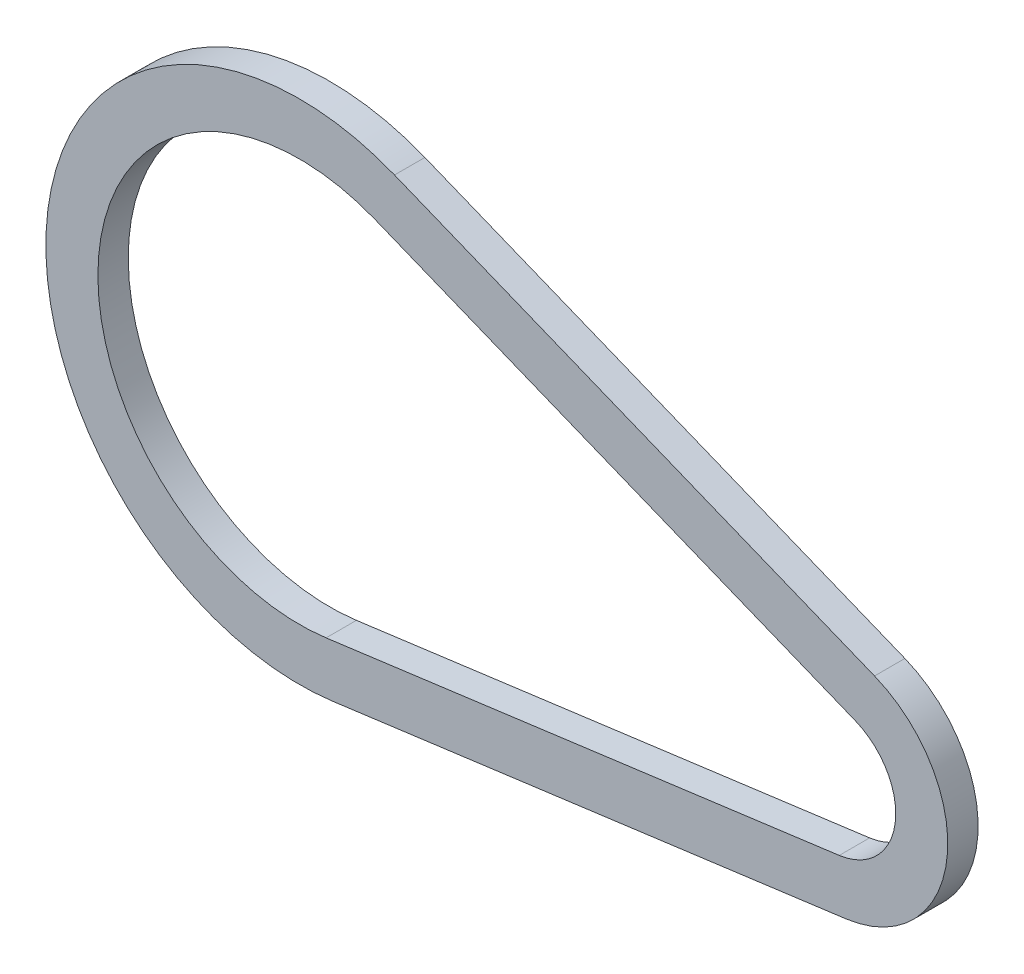
ISO-10303-21;
HEADER;
FILE_DESCRIPTION(('STEP AP214'),'2;1');
FILE_NAME('part.step','',(''),(''),'','','');
FILE_SCHEMA(('AUTOMOTIVE_DESIGN { 1 0 10303 214 1 1 1 1 }'));
ENDSEC;
DATA;
#1=APPLICATION_CONTEXT('core data for automotive mechanical design processes');
#2=APPLICATION_PROTOCOL_DEFINITION('international standard','automotive_design',2000,#1);
#3=PRODUCT_CONTEXT('',#1,'mechanical');
#4=PRODUCT('Part','Part','',(#3));
#5=PRODUCT_RELATED_PRODUCT_CATEGORY('part','',(#4));
#6=PRODUCT_DEFINITION_FORMATION('','',#4);
#7=PRODUCT_DEFINITION_CONTEXT('part definition',#1,'design');
#8=PRODUCT_DEFINITION('design','',#6,#7);
#9=PRODUCT_DEFINITION_SHAPE('','',#8);
#10=(LENGTH_UNIT() NAMED_UNIT(*) SI_UNIT(.MILLI.,.METRE.));
#11=(NAMED_UNIT(*) PLANE_ANGLE_UNIT() SI_UNIT($,.RADIAN.));
#12=(NAMED_UNIT(*) SI_UNIT($,.STERADIAN.) SOLID_ANGLE_UNIT());
#13=UNCERTAINTY_MEASURE_WITH_UNIT(LENGTH_MEASURE(1.E-05),#10,'distance_accuracy_value','');
#14=(GEOMETRIC_REPRESENTATION_CONTEXT(3) GLOBAL_UNCERTAINTY_ASSIGNED_CONTEXT((#13)) GLOBAL_UNIT_ASSIGNED_CONTEXT((#10,
#11,#12)) REPRESENTATION_CONTEXT('',''));
#15=CARTESIAN_POINT('',(0.,0.,0.));
#16=DIRECTION('',(0.,0.,1.));
#17=DIRECTION('',(1.,0.,0.));
#18=AXIS2_PLACEMENT_3D('',#15,#16,#17);
#19=CARTESIAN_POINT('',(-122.5,15.5,3.5));
#20=DIRECTION('',(0.,0.,1.));
#21=DIRECTION('',(1.,0.,0.));
#22=AXIS2_PLACEMENT_3D('',#19,#20,#21);
#23=PLANE('',#22);
#24=CARTESIAN_POINT('',(-122.5,15.5,3.5));
#25=DIRECTION('',(0.,0.,1.));
#26=DIRECTION('',(1.,0.,0.));
#27=AXIS2_PLACEMENT_3D('',#24,#25,#26);
#28=CIRCLE('',#27,58.5);
#29=CARTESIAN_POINT('',(-100.593673118403,69.7435511610056,3.5));
#30=VERTEX_POINT('',#29);
#31=CARTESIAN_POINT('',(-114.79469470372,-42.4903291100431,3.5));
#32=VERTEX_POINT('',#31);
#33=EDGE_CURVE('E134',#30,#32,#28,.T.);
#34=ORIENTED_EDGE('',*,*,#33,.T.);
#35=DIRECTION('',(0.991287677094754,0.131714620449235,0.));
#36=VECTOR('',#35,1.);
#37=CARTESIAN_POINT('',(-114.79469470372,-42.4903291100431,3.5));
#38=LINE('',#37,#36);
#39=CARTESIAN_POINT('',(3.55629475212935,-26.7647672815584,3.5));
#40=VERTEX_POINT('',#39);
#41=EDGE_CURVE('E137',#32,#40,#38,.T.);
#42=ORIENTED_EDGE('',*,*,#41,.T.);
#43=CARTESIAN_POINT('',(0.,0.,3.5));
#44=DIRECTION('',(0.,0.,1.));
#45=DIRECTION('',(1.,0.,0.));
#46=AXIS2_PLACEMENT_3D('',#43,#44,#45);
#47=CIRCLE('',#46,27.);
#48=CARTESIAN_POINT('',(10.1106124068908,25.0354851512334,3.5));
#49=VERTEX_POINT('',#48);
#50=EDGE_CURVE('E140',#40,#49,#47,.T.);
#51=ORIENTED_EDGE('',*,*,#50,.T.);
#52=DIRECTION('',(-0.927240190786421,0.374467126181139,0.));
#53=VECTOR('',#52,1.);
#54=CARTESIAN_POINT('',(-100.593673118403,69.7435511610056,3.5));
#55=LINE('',#54,#53);
#56=EDGE_CURVE('E142',#49,#30,#55,.T.);
#57=ORIENTED_EDGE('',*,*,#56,.T.);
#58=EDGE_LOOP('',(#34,#42,#51,#57));
#59=FACE_BOUND('',#58,.T.);
#60=DIRECTION('',(0.991287677094754,0.131714620449235,0.));
#61=VECTOR('',#60,1.);
#62=CARTESIAN_POINT('',(-116.375270149111,-30.5948769849061,3.5));
#63=LINE('',#62,#61);
#64=CARTESIAN_POINT('',(-116.375270149111,-30.5948769849061,3.5));
#65=VERTEX_POINT('',#64);
#66=CARTESIAN_POINT('',(1.97571930673853,-14.8693151564213,3.5));
#67=VERTEX_POINT('',#66);
#68=EDGE_CURVE('E106',#65,#67,#63,.T.);
#69=ORIENTED_EDGE('',*,*,#68,.F.);
#70=CARTESIAN_POINT('',(-122.5,15.5,3.5));
#71=DIRECTION('',(0.,0.,1.));
#72=DIRECTION('',(1.,0.,0.));
#73=AXIS2_PLACEMENT_3D('',#70,#71,#72);
#74=CIRCLE('',#73,46.5);
#75=CARTESIAN_POINT('',(-105.087278632577,58.6166688715686,3.5));
#76=VERTEX_POINT('',#75);
#77=EDGE_CURVE('E98',#76,#65,#74,.T.);
#78=ORIENTED_EDGE('',*,*,#77,.F.);
#79=DIRECTION('',(-0.927240190786421,0.374467126181139,0.));
#80=VECTOR('',#79,1.);
#81=CARTESIAN_POINT('',(-105.087278632577,58.6166688715686,3.5));
#82=LINE('',#81,#80);
#83=CARTESIAN_POINT('',(5.61700689271707,13.9086028617963,3.5));
#84=VERTEX_POINT('',#83);
#85=EDGE_CURVE('E120',#84,#76,#82,.T.);
#86=ORIENTED_EDGE('',*,*,#85,.F.);
#87=CARTESIAN_POINT('',(0.,0.,3.5));
#88=DIRECTION('',(0.,0.,1.));
#89=DIRECTION('',(1.,0.,0.));
#90=AXIS2_PLACEMENT_3D('',#87,#88,#89);
#91=CIRCLE('',#90,15.);
#92=EDGE_CURVE('E118',#67,#84,#91,.T.);
#93=ORIENTED_EDGE('',*,*,#92,.F.);
#94=EDGE_LOOP('',(#69,#78,#86,#93));
#95=FACE_BOUND('',#94,.T.);
#96=ADVANCED_FACE('F33',(#59,#95),#23,.T.);
#97=CARTESIAN_POINT('',(-122.5,15.5,-3.5));
#98=DIRECTION('',(0.,0.,1.));
#99=DIRECTION('',(1.,0.,0.));
#100=AXIS2_PLACEMENT_3D('',#97,#98,#99);
#101=PLANE('',#100);
#102=CARTESIAN_POINT('',(-122.5,15.5,-3.5));
#103=DIRECTION('',(0.,0.,1.));
#104=DIRECTION('',(1.,0.,0.));
#105=AXIS2_PLACEMENT_3D('',#102,#103,#104);
#106=CIRCLE('',#105,58.5);
#107=CARTESIAN_POINT('',(-100.593673118403,69.7435511610056,-3.5));
#108=VERTEX_POINT('',#107);
#109=CARTESIAN_POINT('',(-114.79469470372,-42.4903291100431,-3.5));
#110=VERTEX_POINT('',#109);
#111=EDGE_CURVE('E114',#108,#110,#106,.T.);
#112=ORIENTED_EDGE('',*,*,#111,.F.);
#113=DIRECTION('',(-0.927240190786421,0.374467126181139,0.));
#114=VECTOR('',#113,1.);
#115=CARTESIAN_POINT('',(-100.593673118403,69.7435511610056,-3.5));
#116=LINE('',#115,#114);
#117=CARTESIAN_POINT('',(10.1106124068908,25.0354851512334,-3.5));
#118=VERTEX_POINT('',#117);
#119=EDGE_CURVE('E138',#118,#108,#116,.T.);
#120=ORIENTED_EDGE('',*,*,#119,.F.);
#121=CARTESIAN_POINT('',(0.,0.,-3.5));
#122=DIRECTION('',(0.,0.,1.));
#123=DIRECTION('',(1.,0.,0.));
#124=AXIS2_PLACEMENT_3D('',#121,#122,#123);
#125=CIRCLE('',#124,27.);
#126=CARTESIAN_POINT('',(3.55629475212935,-26.7647672815584,-3.5));
#127=VERTEX_POINT('',#126);
#128=EDGE_CURVE('E149',#127,#118,#125,.T.);
#129=ORIENTED_EDGE('',*,*,#128,.F.);
#130=DIRECTION('',(0.991287677094754,0.131714620449235,0.));
#131=VECTOR('',#130,1.);
#132=CARTESIAN_POINT('',(-114.79469470372,-42.4903291100431,-3.5));
#133=LINE('',#132,#131);
#134=EDGE_CURVE('E147',#110,#127,#133,.T.);
#135=ORIENTED_EDGE('',*,*,#134,.F.);
#136=EDGE_LOOP('',(#112,#120,#129,#135));
#137=FACE_BOUND('',#136,.T.);
#138=CARTESIAN_POINT('',(-122.5,15.5,-3.5));
#139=DIRECTION('',(0.,0.,1.));
#140=DIRECTION('',(1.,0.,0.));
#141=AXIS2_PLACEMENT_3D('',#138,#139,#140);
#142=CIRCLE('',#141,46.5);
#143=CARTESIAN_POINT('',(-105.087278632577,58.6166688715686,-3.5));
#144=VERTEX_POINT('',#143);
#145=CARTESIAN_POINT('',(-116.375270149111,-30.5948769849061,-3.5));
#146=VERTEX_POINT('',#145);
#147=EDGE_CURVE('E56',#144,#146,#142,.T.);
#148=ORIENTED_EDGE('',*,*,#147,.T.);
#149=DIRECTION('',(0.991287677094754,0.131714620449235,0.));
#150=VECTOR('',#149,1.);
#151=CARTESIAN_POINT('',(-116.375270149111,-30.5948769849061,-3.5));
#152=LINE('',#151,#150);
#153=CARTESIAN_POINT('',(1.97571930673853,-14.8693151564213,-3.5));
#154=VERTEX_POINT('',#153);
#155=EDGE_CURVE('E113',#146,#154,#152,.T.);
#156=ORIENTED_EDGE('',*,*,#155,.T.);
#157=CARTESIAN_POINT('',(0.,0.,-3.5));
#158=DIRECTION('',(0.,0.,1.));
#159=DIRECTION('',(1.,0.,0.));
#160=AXIS2_PLACEMENT_3D('',#157,#158,#159);
#161=CIRCLE('',#160,15.);
#162=CARTESIAN_POINT('',(5.61700689271708,13.9086028617963,-3.5));
#163=VERTEX_POINT('',#162);
#164=EDGE_CURVE('E126',#154,#163,#161,.T.);
#165=ORIENTED_EDGE('',*,*,#164,.T.);
#166=DIRECTION('',(-0.927240190786421,0.374467126181139,0.));
#167=VECTOR('',#166,1.);
#168=CARTESIAN_POINT('',(-105.087278632577,58.6166688715686,-3.5));
#169=LINE('',#168,#167);
#170=EDGE_CURVE('E107',#163,#144,#169,.T.);
#171=ORIENTED_EDGE('',*,*,#170,.T.);
#172=EDGE_LOOP('',(#148,#156,#165,#171));
#173=FACE_BOUND('',#172,.T.);
#174=ADVANCED_FACE('F167',(#137,#173),#101,.F.);
#175=CARTESIAN_POINT('',(-122.5,15.5,3.5));
#176=DIRECTION('',(0.,0.,-1.));
#177=DIRECTION('',(-1.,0.,0.));
#178=AXIS2_PLACEMENT_3D('',#175,#176,#177);
#179=CYLINDRICAL_SURFACE('',#178,58.5);
#180=ORIENTED_EDGE('',*,*,#111,.T.);
#181=DIRECTION('',(0.,0.,-1.));
#182=VECTOR('',#181,1.);
#183=CARTESIAN_POINT('',(-114.79469470372,-42.4903291100431,3.5));
#184=LINE('',#183,#182);
#185=EDGE_CURVE('E11',#32,#110,#184,.T.);
#186=ORIENTED_EDGE('',*,*,#185,.F.);
#187=ORIENTED_EDGE('',*,*,#33,.F.);
#188=DIRECTION('',(0.,0.,-1.));
#189=VECTOR('',#188,1.);
#190=CARTESIAN_POINT('',(-100.593673118403,69.7435511610056,3.5));
#191=LINE('',#190,#189);
#192=EDGE_CURVE('E144',#30,#108,#191,.T.);
#193=ORIENTED_EDGE('',*,*,#192,.T.);
#194=EDGE_LOOP('',(#180,#186,#187,#193));
#195=FACE_BOUND('',#194,.T.);
#196=ADVANCED_FACE('F35',(#195),#179,.T.);
#197=CARTESIAN_POINT('',(-114.79469470372,-42.4903291100431,3.5));
#198=DIRECTION('',(-0.131714620449235,0.991287677094754,0.));
#199=DIRECTION('',(-0.991287677094754,-0.131714620449235,0.));
#200=AXIS2_PLACEMENT_3D('',#197,#198,#199);
#201=PLANE('',#200);
#202=ORIENTED_EDGE('',*,*,#134,.T.);
#203=DIRECTION('',(0.,0.,-1.));
#204=VECTOR('',#203,1.);
#205=CARTESIAN_POINT('',(3.55629475212935,-26.7647672815584,3.5));
#206=LINE('',#205,#204);
#207=EDGE_CURVE('E41',#40,#127,#206,.T.);
#208=ORIENTED_EDGE('',*,*,#207,.F.);
#209=ORIENTED_EDGE('',*,*,#41,.F.);
#210=ORIENTED_EDGE('',*,*,#185,.T.);
#211=EDGE_LOOP('',(#202,#208,#209,#210));
#212=FACE_BOUND('',#211,.T.);
#213=ADVANCED_FACE('F177',(#212),#201,.F.);
#214=CARTESIAN_POINT('',(0.,0.,3.5));
#215=DIRECTION('',(0.,0.,-1.));
#216=DIRECTION('',(-1.,0.,0.));
#217=AXIS2_PLACEMENT_3D('',#214,#215,#216);
#218=CYLINDRICAL_SURFACE('',#217,27.);
#219=ORIENTED_EDGE('',*,*,#128,.T.);
#220=DIRECTION('',(0.,0.,-1.));
#221=VECTOR('',#220,1.);
#222=CARTESIAN_POINT('',(10.1106124068908,25.0354851512334,3.5));
#223=LINE('',#222,#221);
#224=EDGE_CURVE('E154',#49,#118,#223,.T.);
#225=ORIENTED_EDGE('',*,*,#224,.F.);
#226=ORIENTED_EDGE('',*,*,#50,.F.);
#227=ORIENTED_EDGE('',*,*,#207,.T.);
#228=EDGE_LOOP('',(#219,#225,#226,#227));
#229=FACE_BOUND('',#228,.T.);
#230=ADVANCED_FACE('F161',(#229),#218,.T.);
#231=CARTESIAN_POINT('',(-100.593673118403,69.7435511610056,3.5));
#232=DIRECTION('',(-0.374467126181139,-0.927240190786421,0.));
#233=DIRECTION('',(0.927240190786421,-0.374467126181139,0.));
#234=AXIS2_PLACEMENT_3D('',#231,#232,#233);
#235=PLANE('',#234);
#236=ORIENTED_EDGE('',*,*,#119,.T.);
#237=ORIENTED_EDGE('',*,*,#192,.F.);
#238=ORIENTED_EDGE('',*,*,#56,.F.);
#239=ORIENTED_EDGE('',*,*,#224,.T.);
#240=EDGE_LOOP('',(#236,#237,#238,#239));
#241=FACE_BOUND('',#240,.T.);
#242=ADVANCED_FACE('F171',(#241),#235,.F.);
#243=CARTESIAN_POINT('',(-122.5,15.5,3.5));
#244=DIRECTION('',(0.,0.,-1.));
#245=DIRECTION('',(-1.,0.,0.));
#246=AXIS2_PLACEMENT_3D('',#243,#244,#245);
#247=CYLINDRICAL_SURFACE('',#246,46.5);
#248=ORIENTED_EDGE('',*,*,#147,.F.);
#249=DIRECTION('',(0.,0.,-1.));
#250=VECTOR('',#249,1.);
#251=CARTESIAN_POINT('',(-105.087278632577,58.6166688715686,3.5));
#252=LINE('',#251,#250);
#253=EDGE_CURVE('E102',#76,#144,#252,.T.);
#254=ORIENTED_EDGE('',*,*,#253,.F.);
#255=ORIENTED_EDGE('',*,*,#77,.T.);
#256=DIRECTION('',(0.,0.,-1.));
#257=VECTOR('',#256,1.);
#258=CARTESIAN_POINT('',(-116.375270149111,-30.5948769849061,3.5));
#259=LINE('',#258,#257);
#260=EDGE_CURVE('E101',#65,#146,#259,.T.);
#261=ORIENTED_EDGE('',*,*,#260,.T.);
#262=EDGE_LOOP('',(#248,#254,#255,#261));
#263=FACE_BOUND('',#262,.T.);
#264=ADVANCED_FACE('F100',(#263),#247,.F.);
#265=CARTESIAN_POINT('',(-116.375270149111,-30.5948769849061,3.5));
#266=DIRECTION('',(-0.131714620449235,0.991287677094754,0.));
#267=DIRECTION('',(-0.991287677094754,-0.131714620449235,0.));
#268=AXIS2_PLACEMENT_3D('',#265,#266,#267);
#269=PLANE('',#268);
#270=ORIENTED_EDGE('',*,*,#155,.F.);
#271=ORIENTED_EDGE('',*,*,#260,.F.);
#272=ORIENTED_EDGE('',*,*,#68,.T.);
#273=DIRECTION('',(0.,0.,-1.));
#274=VECTOR('',#273,1.);
#275=CARTESIAN_POINT('',(1.97571930673853,-14.8693151564213,3.5));
#276=LINE('',#275,#274);
#277=EDGE_CURVE('E115',#67,#154,#276,.T.);
#278=ORIENTED_EDGE('',*,*,#277,.T.);
#279=EDGE_LOOP('',(#270,#271,#272,#278));
#280=FACE_BOUND('',#279,.T.);
#281=ADVANCED_FACE('F110',(#280),#269,.T.);
#282=CARTESIAN_POINT('',(0.,0.,3.5));
#283=DIRECTION('',(0.,0.,-1.));
#284=DIRECTION('',(-1.,0.,0.));
#285=AXIS2_PLACEMENT_3D('',#282,#283,#284);
#286=CYLINDRICAL_SURFACE('',#285,15.);
#287=ORIENTED_EDGE('',*,*,#164,.F.);
#288=ORIENTED_EDGE('',*,*,#277,.F.);
#289=ORIENTED_EDGE('',*,*,#92,.T.);
#290=DIRECTION('',(0.,0.,-1.));
#291=VECTOR('',#290,1.);
#292=CARTESIAN_POINT('',(5.61700689271708,13.9086028617963,3.5));
#293=LINE('',#292,#291);
#294=EDGE_CURVE('E48',#84,#163,#293,.T.);
#295=ORIENTED_EDGE('',*,*,#294,.T.);
#296=EDGE_LOOP('',(#287,#288,#289,#295));
#297=FACE_BOUND('',#296,.T.);
#298=ADVANCED_FACE('F200',(#297),#286,.F.);
#299=CARTESIAN_POINT('',(-105.087278632577,58.6166688715686,3.5));
#300=DIRECTION('',(-0.374467126181139,-0.927240190786421,0.));
#301=DIRECTION('',(0.927240190786421,-0.374467126181139,0.));
#302=AXIS2_PLACEMENT_3D('',#299,#300,#301);
#303=PLANE('',#302);
#304=ORIENTED_EDGE('',*,*,#170,.F.);
#305=ORIENTED_EDGE('',*,*,#294,.F.);
#306=ORIENTED_EDGE('',*,*,#85,.T.);
#307=ORIENTED_EDGE('',*,*,#253,.T.);
#308=EDGE_LOOP('',(#304,#305,#306,#307));
#309=FACE_BOUND('',#308,.T.);
#310=ADVANCED_FACE('F204',(#309),#303,.T.);
#311=CLOSED_SHELL('',(#96,#174,#196,#213,#230,#242,#264,#281,#298,#310));
#312=MANIFOLD_SOLID_BREP('B2',#311);
#313=ADVANCED_BREP_SHAPE_REPRESENTATION('',(#18,#312),#14);
#314=SHAPE_DEFINITION_REPRESENTATION(#9,#313);
ENDSEC;
END-ISO-10303-21;
